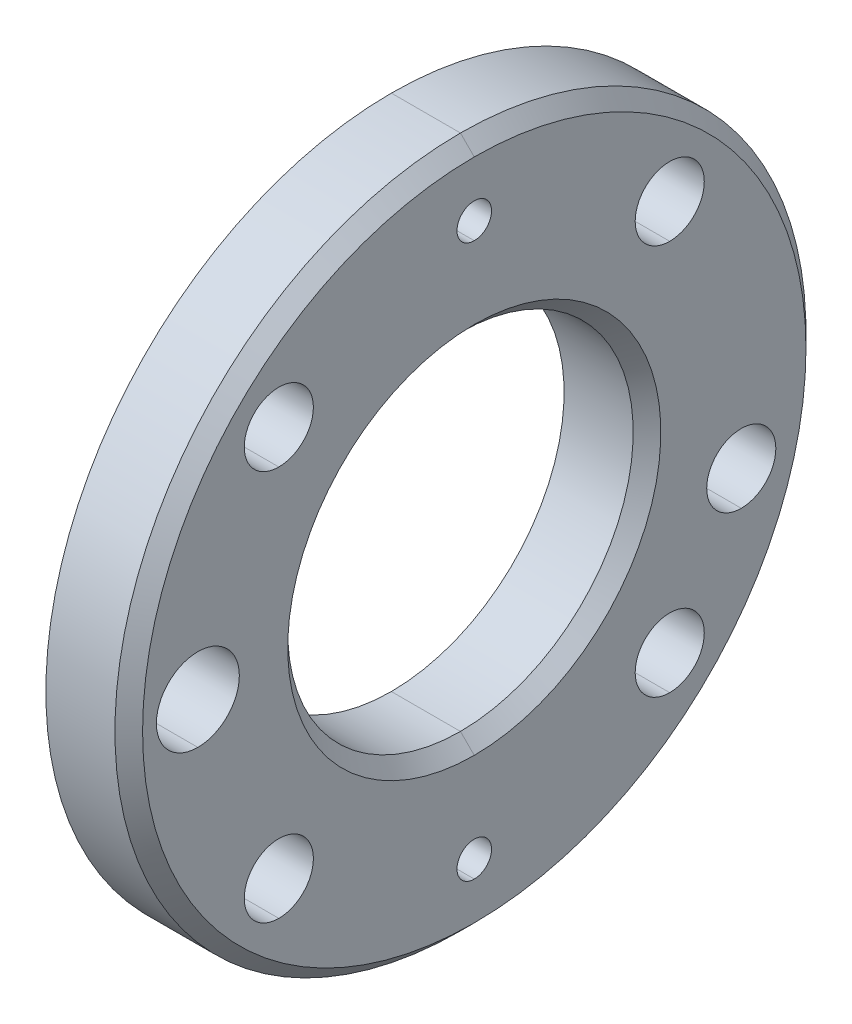
ISO-10303-21;
HEADER;
FILE_DESCRIPTION(('STEP AP214'),'2;1');
FILE_NAME('part.step','',(''),(''),'','','');
FILE_SCHEMA(('AUTOMOTIVE_DESIGN { 1 0 10303 214 1 1 1 1 }'));
ENDSEC;
DATA;
#1=APPLICATION_CONTEXT('core data for automotive mechanical design processes');
#2=APPLICATION_PROTOCOL_DEFINITION('international standard','automotive_design',2000,#1);
#3=PRODUCT_CONTEXT('',#1,'mechanical');
#4=PRODUCT('Part','Part','',(#3));
#5=PRODUCT_RELATED_PRODUCT_CATEGORY('part','',(#4));
#6=PRODUCT_DEFINITION_FORMATION('','',#4);
#7=PRODUCT_DEFINITION_CONTEXT('part definition',#1,'design');
#8=PRODUCT_DEFINITION('design','',#6,#7);
#9=PRODUCT_DEFINITION_SHAPE('','',#8);
#10=(LENGTH_UNIT() NAMED_UNIT(*) SI_UNIT(.MILLI.,.METRE.));
#11=(NAMED_UNIT(*) PLANE_ANGLE_UNIT() SI_UNIT($,.RADIAN.));
#12=(NAMED_UNIT(*) SI_UNIT($,.STERADIAN.) SOLID_ANGLE_UNIT());
#13=UNCERTAINTY_MEASURE_WITH_UNIT(LENGTH_MEASURE(1.E-05),#10,'distance_accuracy_value','');
#14=(GEOMETRIC_REPRESENTATION_CONTEXT(3) GLOBAL_UNCERTAINTY_ASSIGNED_CONTEXT((#13)) GLOBAL_UNIT_ASSIGNED_CONTEXT((#10,
#11,#12)) REPRESENTATION_CONTEXT('',''));
#15=CARTESIAN_POINT('',(0.,0.,0.));
#16=DIRECTION('',(0.,0.,1.));
#17=DIRECTION('',(1.,0.,0.));
#18=AXIS2_PLACEMENT_3D('',#15,#16,#17);
#19=CARTESIAN_POINT('',(559.,1.07884340678323E-10,1009.));
#20=DIRECTION('',(1.,0.,0.));
#21=DIRECTION('',(0.,-1.,0.));
#22=AXIS2_PLACEMENT_3D('',#19,#20,#21);
#23=PLANE('',#22);
#24=CARTESIAN_POINT('',(559.,1.07884340678323E-10,1009.));
#25=DIRECTION('',(-1.,0.,0.));
#26=DIRECTION('',(0.,-0.999972178095451,0.00745942591894533));
#27=AXIS2_PLACEMENT_3D('',#24,#25,#26);
#28=CIRCLE('',#27,12.5);
#29=CARTESIAN_POINT('',(559.,-12.4999999998921,1009.));
#30=VERTEX_POINT('',#29);
#31=CARTESIAN_POINT('',(559.,12.5000000001079,1009.));
#32=VERTEX_POINT('',#31);
#33=EDGE_CURVE('E434',#30,#32,#28,.T.);
#34=ORIENTED_EDGE('',*,*,#33,.F.);
#35=CARTESIAN_POINT('',(559.,1.07884340678323E-10,1009.));
#36=DIRECTION('',(-1.,0.,0.));
#37=DIRECTION('',(0.,-0.999972178095451,0.00745942591894533));
#38=AXIS2_PLACEMENT_3D('',#35,#36,#37);
#39=CIRCLE('',#38,12.5);
#40=EDGE_CURVE('E25',#32,#30,#39,.T.);
#41=ORIENTED_EDGE('',*,*,#40,.F.);
#42=EDGE_LOOP('',(#34,#41));
#43=FACE_BOUND('',#42,.T.);
#44=CARTESIAN_POINT('',(559.,20.0000000001079,1009.));
#45=DIRECTION('',(-1.,0.,0.));
#46=DIRECTION('',(0.,-0.999972178095451,0.0074594259189098));
#47=AXIS2_PLACEMENT_3D('',#44,#45,#46);
#48=CIRCLE('',#47,1.25);
#49=CARTESIAN_POINT('',(559.,21.2500000001079,1009.));
#50=VERTEX_POINT('',#49);
#51=CARTESIAN_POINT('',(559.,18.7500000001079,1009.));
#52=VERTEX_POINT('',#51);
#53=EDGE_CURVE('E356',#50,#52,#48,.T.);
#54=ORIENTED_EDGE('',*,*,#53,.F.);
#55=CARTESIAN_POINT('',(559.,20.0000000001079,1009.));
#56=DIRECTION('',(-1.,0.,0.));
#57=DIRECTION('',(0.,-0.999972178095451,0.0074594259189098));
#58=AXIS2_PLACEMENT_3D('',#55,#56,#57);
#59=CIRCLE('',#58,1.25);
#60=EDGE_CURVE('E459',#52,#50,#59,.T.);
#61=ORIENTED_EDGE('',*,*,#60,.F.);
#62=EDGE_LOOP('',(#54,#61));
#63=FACE_BOUND('',#62,.T.);
#64=CARTESIAN_POINT('',(559.,14.1421356238387,994.857864376269));
#65=DIRECTION('',(-1.,0.,0.));
#66=DIRECTION('',(0.,-0.999972178095451,0.00745942591895421));
#67=AXIS2_PLACEMENT_3D('',#64,#65,#66);
#68=CIRCLE('',#67,2.5);
#69=CARTESIAN_POINT('',(559.,16.6421356238387,994.857864376269));
#70=VERTEX_POINT('',#69);
#71=CARTESIAN_POINT('',(559.,11.6421356238387,994.857864376269));
#72=VERTEX_POINT('',#71);
#73=EDGE_CURVE('E247',#70,#72,#68,.T.);
#74=ORIENTED_EDGE('',*,*,#73,.F.);
#75=CARTESIAN_POINT('',(559.,14.1421356238387,994.857864376269));
#76=DIRECTION('',(-1.,0.,0.));
#77=DIRECTION('',(0.,-0.999972178095451,0.00745942591895421));
#78=AXIS2_PLACEMENT_3D('',#75,#76,#77);
#79=CIRCLE('',#78,2.5);
#80=EDGE_CURVE('E258',#72,#70,#79,.T.);
#81=ORIENTED_EDGE('',*,*,#80,.F.);
#82=EDGE_LOOP('',(#74,#81));
#83=FACE_BOUND('',#82,.T.);
#84=CARTESIAN_POINT('',(559.,-14.1421356236229,1023.14213562373));
#85=DIRECTION('',(-1.,0.,0.));
#86=DIRECTION('',(0.,-0.999972178095451,0.0074594259189098));
#87=AXIS2_PLACEMENT_3D('',#84,#85,#86);
#88=CIRCLE('',#87,2.5);
#89=CARTESIAN_POINT('',(559.,-11.6421356236229,1023.14213562373));
#90=VERTEX_POINT('',#89);
#91=CARTESIAN_POINT('',(559.,-16.6421356236229,1023.14213562373));
#92=VERTEX_POINT('',#91);
#93=EDGE_CURVE('E378',#90,#92,#88,.T.);
#94=ORIENTED_EDGE('',*,*,#93,.F.);
#95=CARTESIAN_POINT('',(559.,-14.1421356236229,1023.14213562373));
#96=DIRECTION('',(-1.,0.,0.));
#97=DIRECTION('',(0.,-0.999972178095451,0.0074594259189098));
#98=AXIS2_PLACEMENT_3D('',#95,#96,#97);
#99=CIRCLE('',#98,2.5);
#100=EDGE_CURVE('E290',#92,#90,#99,.T.);
#101=ORIENTED_EDGE('',*,*,#100,.F.);
#102=EDGE_LOOP('',(#94,#101));
#103=FACE_BOUND('',#102,.T.);
#104=CARTESIAN_POINT('',(559.,1.08042562526819E-10,1029.));
#105=DIRECTION('',(-1.,0.,0.));
#106=DIRECTION('',(0.,-0.999972178095451,0.00745942591895421));
#107=AXIS2_PLACEMENT_3D('',#104,#105,#106);
#108=CIRCLE('',#107,3.);
#109=CARTESIAN_POINT('',(559.,3.00000000010805,1029.));
#110=VERTEX_POINT('',#109);
#111=CARTESIAN_POINT('',(559.,-2.99999999989195,1029.));
#112=VERTEX_POINT('',#111);
#113=EDGE_CURVE('E37',#110,#112,#108,.T.);
#114=ORIENTED_EDGE('',*,*,#113,.F.);
#115=CARTESIAN_POINT('',(559.,1.08042562526819E-10,1029.));
#116=DIRECTION('',(-1.,0.,0.));
#117=DIRECTION('',(0.,-0.999972178095451,0.00745942591895421));
#118=AXIS2_PLACEMENT_3D('',#115,#116,#117);
#119=CIRCLE('',#118,3.);
#120=EDGE_CURVE('E239',#112,#110,#119,.T.);
#121=ORIENTED_EDGE('',*,*,#120,.F.);
#122=EDGE_LOOP('',(#114,#121));
#123=FACE_BOUND('',#122,.T.);
#124=CARTESIAN_POINT('',(559.,-5.1763809019427,989.681483474218));
#125=DIRECTION('',(-1.,0.,0.));
#126=DIRECTION('',(0.,-0.999972178095451,0.00745942591895421));
#127=AXIS2_PLACEMENT_3D('',#124,#125,#126);
#128=CIRCLE('',#127,2.5);
#129=CARTESIAN_POINT('',(559.,-2.6763809019427,989.681483474218));
#130=VERTEX_POINT('',#129);
#131=CARTESIAN_POINT('',(559.,-7.6763809019427,989.681483474218));
#132=VERTEX_POINT('',#131);
#133=EDGE_CURVE('E233',#130,#132,#128,.T.);
#134=ORIENTED_EDGE('',*,*,#133,.F.);
#135=CARTESIAN_POINT('',(559.,-5.1763809019427,989.681483474218));
#136=DIRECTION('',(-1.,0.,0.));
#137=DIRECTION('',(0.,-0.999972178095451,0.00745942591895421));
#138=AXIS2_PLACEMENT_3D('',#135,#136,#137);
#139=CIRCLE('',#138,2.5);
#140=EDGE_CURVE('E307',#132,#130,#139,.T.);
#141=ORIENTED_EDGE('',*,*,#140,.F.);
#142=EDGE_LOOP('',(#134,#141));
#143=FACE_BOUND('',#142,.T.);
#144=CARTESIAN_POINT('',(559.,14.142135623839,1023.14213562373));
#145=DIRECTION('',(-1.,0.,0.));
#146=DIRECTION('',(0.,-0.999972178095451,0.0074594259189098));
#147=AXIS2_PLACEMENT_3D('',#144,#145,#146);
#148=CIRCLE('',#147,2.5);
#149=CARTESIAN_POINT('',(559.,16.642135623839,1023.14213562373));
#150=VERTEX_POINT('',#149);
#151=CARTESIAN_POINT('',(559.,11.642135623839,1023.14213562373));
#152=VERTEX_POINT('',#151);
#153=EDGE_CURVE('E357',#150,#152,#148,.T.);
#154=ORIENTED_EDGE('',*,*,#153,.F.);
#155=CARTESIAN_POINT('',(559.,14.142135623839,1023.14213562373));
#156=DIRECTION('',(-1.,0.,0.));
#157=DIRECTION('',(0.,-0.999972178095451,0.0074594259189098));
#158=AXIS2_PLACEMENT_3D('',#155,#156,#157);
#159=CIRCLE('',#158,2.5);
#160=EDGE_CURVE('E274',#152,#150,#159,.T.);
#161=ORIENTED_EDGE('',*,*,#160,.F.);
#162=EDGE_LOOP('',(#154,#161));
#163=FACE_BOUND('',#162,.T.);
#164=CARTESIAN_POINT('',(559.,-14.1421356236234,994.857864376269));
#165=DIRECTION('',(-1.,0.,0.));
#166=DIRECTION('',(0.,-0.999972178095451,0.00745942591895421));
#167=AXIS2_PLACEMENT_3D('',#164,#165,#166);
#168=CIRCLE('',#167,2.5);
#169=CARTESIAN_POINT('',(559.,-11.6421356236234,994.857864376269));
#170=VERTEX_POINT('',#169);
#171=CARTESIAN_POINT('',(559.,-16.6421356236234,994.857864376269));
#172=VERTEX_POINT('',#171);
#173=EDGE_CURVE('E204',#170,#172,#168,.T.);
#174=ORIENTED_EDGE('',*,*,#173,.F.);
#175=CARTESIAN_POINT('',(559.,-14.1421356236234,994.857864376269));
#176=DIRECTION('',(-1.,0.,0.));
#177=DIRECTION('',(0.,-0.999972178095451,0.00745942591895421));
#178=AXIS2_PLACEMENT_3D('',#175,#176,#177);
#179=CIRCLE('',#178,2.5);
#180=EDGE_CURVE('E216',#172,#170,#179,.T.);
#181=ORIENTED_EDGE('',*,*,#180,.F.);
#182=EDGE_LOOP('',(#174,#181));
#183=FACE_BOUND('',#182,.T.);
#184=CARTESIAN_POINT('',(559.,-19.9999999998921,1009.));
#185=DIRECTION('',(-1.,0.,0.));
#186=DIRECTION('',(0.,-0.999972178095451,0.0074594259189098));
#187=AXIS2_PLACEMENT_3D('',#184,#185,#186);
#188=CIRCLE('',#187,1.25);
#189=CARTESIAN_POINT('',(559.,-18.7499999998921,1009.));
#190=VERTEX_POINT('',#189);
#191=CARTESIAN_POINT('',(559.,-21.2499999998921,1009.));
#192=VERTEX_POINT('',#191);
#193=EDGE_CURVE('E244',#190,#192,#188,.T.);
#194=ORIENTED_EDGE('',*,*,#193,.F.);
#195=CARTESIAN_POINT('',(559.,-19.9999999998921,1009.));
#196=DIRECTION('',(-1.,0.,0.));
#197=DIRECTION('',(0.,-0.999972178095451,0.0074594259189098));
#198=AXIS2_PLACEMENT_3D('',#195,#196,#197);
#199=CIRCLE('',#198,1.25);
#200=EDGE_CURVE('E405',#192,#190,#199,.T.);
#201=ORIENTED_EDGE('',*,*,#200,.F.);
#202=EDGE_LOOP('',(#194,#201));
#203=FACE_BOUND('',#202,.T.);
#204=CARTESIAN_POINT('',(559.,1.07884340678323E-10,1009.));
#205=DIRECTION('',(-1.,0.,0.));
#206=DIRECTION('',(0.,-0.999972178095451,0.00745942591894533));
#207=AXIS2_PLACEMENT_3D('',#204,#205,#206);
#208=CIRCLE('',#207,25.);
#209=CARTESIAN_POINT('',(559.,-24.9999999998921,1009.));
#210=VERTEX_POINT('',#209);
#211=CARTESIAN_POINT('',(559.,25.0000000001079,1009.));
#212=VERTEX_POINT('',#211);
#213=EDGE_CURVE('E11',#210,#212,#208,.T.);
#214=ORIENTED_EDGE('',*,*,#213,.T.);
#215=CARTESIAN_POINT('',(559.,1.07884340678323E-10,1009.));
#216=DIRECTION('',(-1.,0.,0.));
#217=DIRECTION('',(0.,-0.999972178095451,0.00745942591894533));
#218=AXIS2_PLACEMENT_3D('',#215,#216,#217);
#219=CIRCLE('',#218,25.);
#220=EDGE_CURVE('E543',#212,#210,#219,.T.);
#221=ORIENTED_EDGE('',*,*,#220,.T.);
#222=EDGE_LOOP('',(#214,#221));
#223=FACE_BOUND('',#222,.T.);
#224=ADVANCED_FACE('F17',(#43,#63,#83,#103,#123,#143,#163,#183,#203,#223),#23,.F.);
#225=CARTESIAN_POINT('',(565.,1.0803998754666E-10,1034.));
#226=DIRECTION('',(1.,0.,0.));
#227=DIRECTION('',(0.,-1.,0.));
#228=AXIS2_PLACEMENT_3D('',#225,#226,#227);
#229=PLANE('',#228);
#230=CARTESIAN_POINT('',(565.,-19.9999999998922,1009.));
#231=DIRECTION('',(-1.,0.,0.));
#232=DIRECTION('',(0.,1.,0.));
#233=AXIS2_PLACEMENT_3D('',#230,#231,#232);
#234=CIRCLE('',#233,1.25);
#235=CARTESIAN_POINT('',(565.,-18.7499999998922,1009.));
#236=VERTEX_POINT('',#235);
#237=CARTESIAN_POINT('',(565.,-21.2499999998922,1009.));
#238=VERTEX_POINT('',#237);
#239=EDGE_CURVE('E352',#236,#238,#234,.T.);
#240=ORIENTED_EDGE('',*,*,#239,.T.);
#241=CARTESIAN_POINT('',(565.,-19.9999999998922,1009.));
#242=DIRECTION('',(-1.,0.,0.));
#243=DIRECTION('',(0.,1.,0.));
#244=AXIS2_PLACEMENT_3D('',#241,#242,#243);
#245=CIRCLE('',#244,1.25);
#246=EDGE_CURVE('E412',#238,#236,#245,.T.);
#247=ORIENTED_EDGE('',*,*,#246,.T.);
#248=EDGE_LOOP('',(#240,#247));
#249=FACE_BOUND('',#248,.T.);
#250=CARTESIAN_POINT('',(565.,20.0000000001079,1009.));
#251=DIRECTION('',(-1.,0.,0.));
#252=DIRECTION('',(0.,1.,0.));
#253=AXIS2_PLACEMENT_3D('',#250,#251,#252);
#254=CIRCLE('',#253,1.25);
#255=CARTESIAN_POINT('',(565.,21.2500000001079,1009.));
#256=VERTEX_POINT('',#255);
#257=CARTESIAN_POINT('',(565.,18.7500000001078,1009.));
#258=VERTEX_POINT('',#257);
#259=EDGE_CURVE('E214',#256,#258,#254,.T.);
#260=ORIENTED_EDGE('',*,*,#259,.T.);
#261=CARTESIAN_POINT('',(565.,20.0000000001079,1009.));
#262=DIRECTION('',(-1.,0.,0.));
#263=DIRECTION('',(0.,1.,0.));
#264=AXIS2_PLACEMENT_3D('',#261,#262,#263);
#265=CIRCLE('',#264,1.25);
#266=EDGE_CURVE('E451',#258,#256,#265,.T.);
#267=ORIENTED_EDGE('',*,*,#266,.T.);
#268=EDGE_LOOP('',(#260,#267));
#269=FACE_BOUND('',#268,.T.);
#270=CARTESIAN_POINT('',(565.,-14.1421356236234,994.857864376269));
#271=DIRECTION('',(-1.,0.,0.));
#272=DIRECTION('',(0.,1.,0.));
#273=AXIS2_PLACEMENT_3D('',#270,#271,#272);
#274=CIRCLE('',#273,2.5);
#275=CARTESIAN_POINT('',(565.,-11.6421356236234,994.857864376269));
#276=VERTEX_POINT('',#275);
#277=CARTESIAN_POINT('',(565.,-16.6421356236234,994.857864376269));
#278=VERTEX_POINT('',#277);
#279=EDGE_CURVE('E199',#276,#278,#274,.T.);
#280=ORIENTED_EDGE('',*,*,#279,.T.);
#281=CARTESIAN_POINT('',(565.,-14.1421356236234,994.857864376269));
#282=DIRECTION('',(-1.,0.,0.));
#283=DIRECTION('',(0.,1.,0.));
#284=AXIS2_PLACEMENT_3D('',#281,#282,#283);
#285=CIRCLE('',#284,2.5);
#286=EDGE_CURVE('E223',#278,#276,#285,.T.);
#287=ORIENTED_EDGE('',*,*,#286,.T.);
#288=EDGE_LOOP('',(#280,#287));
#289=FACE_BOUND('',#288,.T.);
#290=CARTESIAN_POINT('',(565.,14.1421356238387,994.857864376269));
#291=DIRECTION('',(-1.,0.,0.));
#292=DIRECTION('',(0.,1.,0.));
#293=AXIS2_PLACEMENT_3D('',#290,#291,#292);
#294=CIRCLE('',#293,2.5);
#295=CARTESIAN_POINT('',(565.,16.6421356238387,994.857864376269));
#296=VERTEX_POINT('',#295);
#297=CARTESIAN_POINT('',(565.,11.6421356238387,994.857864376269));
#298=VERTEX_POINT('',#297);
#299=EDGE_CURVE('E360',#296,#298,#294,.T.);
#300=ORIENTED_EDGE('',*,*,#299,.T.);
#301=CARTESIAN_POINT('',(565.,14.1421356238387,994.857864376269));
#302=DIRECTION('',(-1.,0.,0.));
#303=DIRECTION('',(0.,1.,0.));
#304=AXIS2_PLACEMENT_3D('',#301,#302,#303);
#305=CIRCLE('',#304,2.5);
#306=EDGE_CURVE('E250',#298,#296,#305,.T.);
#307=ORIENTED_EDGE('',*,*,#306,.T.);
#308=EDGE_LOOP('',(#300,#307));
#309=FACE_BOUND('',#308,.T.);
#310=CARTESIAN_POINT('',(565.,14.142135623839,1023.14213562373));
#311=DIRECTION('',(-1.,0.,0.));
#312=DIRECTION('',(0.,1.,0.));
#313=AXIS2_PLACEMENT_3D('',#310,#311,#312);
#314=CIRCLE('',#313,2.5);
#315=CARTESIAN_POINT('',(565.,16.642135623839,1023.14213562373));
#316=VERTEX_POINT('',#315);
#317=CARTESIAN_POINT('',(565.,11.642135623839,1023.14213562373));
#318=VERTEX_POINT('',#317);
#319=EDGE_CURVE('E361',#316,#318,#314,.T.);
#320=ORIENTED_EDGE('',*,*,#319,.T.);
#321=CARTESIAN_POINT('',(565.,14.142135623839,1023.14213562373));
#322=DIRECTION('',(-1.,0.,0.));
#323=DIRECTION('',(0.,1.,0.));
#324=AXIS2_PLACEMENT_3D('',#321,#322,#323);
#325=CIRCLE('',#324,2.5);
#326=EDGE_CURVE('E266',#318,#316,#325,.T.);
#327=ORIENTED_EDGE('',*,*,#326,.T.);
#328=EDGE_LOOP('',(#320,#327));
#329=FACE_BOUND('',#328,.T.);
#330=CARTESIAN_POINT('',(565.,-14.142135623623,1023.14213562373));
#331=DIRECTION('',(-1.,0.,0.));
#332=DIRECTION('',(0.,1.,0.));
#333=AXIS2_PLACEMENT_3D('',#330,#331,#332);
#334=CIRCLE('',#333,2.5);
#335=CARTESIAN_POINT('',(565.,-11.642135623623,1023.14213562373));
#336=VERTEX_POINT('',#335);
#337=CARTESIAN_POINT('',(565.,-16.642135623623,1023.14213562373));
#338=VERTEX_POINT('',#337);
#339=EDGE_CURVE('E375',#336,#338,#334,.T.);
#340=ORIENTED_EDGE('',*,*,#339,.T.);
#341=CARTESIAN_POINT('',(565.,-14.142135623623,1023.14213562373));
#342=DIRECTION('',(-1.,0.,0.));
#343=DIRECTION('',(0.,1.,0.));
#344=AXIS2_PLACEMENT_3D('',#341,#342,#343);
#345=CIRCLE('',#344,2.5);
#346=EDGE_CURVE('E282',#338,#336,#345,.T.);
#347=ORIENTED_EDGE('',*,*,#346,.T.);
#348=EDGE_LOOP('',(#340,#347));
#349=FACE_BOUND('',#348,.T.);
#350=CARTESIAN_POINT('',(565.,1.07842450208488E-10,1009.));
#351=DIRECTION('',(-1.,0.,0.));
#352=DIRECTION('',(0.,1.,0.));
#353=AXIS2_PLACEMENT_3D('',#350,#351,#352);
#354=CIRCLE('',#353,13.5);
#355=CARTESIAN_POINT('',(565.,13.5000000001078,1009.));
#356=VERTEX_POINT('',#355);
#357=CARTESIAN_POINT('',(565.,-13.4999999998922,1009.));
#358=VERTEX_POINT('',#357);
#359=EDGE_CURVE('E312',#356,#358,#354,.T.);
#360=ORIENTED_EDGE('',*,*,#359,.T.);
#361=CARTESIAN_POINT('',(565.,1.07842450208488E-10,1009.));
#362=DIRECTION('',(-1.,0.,0.));
#363=DIRECTION('',(0.,1.,0.));
#364=AXIS2_PLACEMENT_3D('',#361,#362,#363);
#365=CIRCLE('',#364,13.5);
#366=EDGE_CURVE('E371',#358,#356,#365,.T.);
#367=ORIENTED_EDGE('',*,*,#366,.T.);
#368=EDGE_LOOP('',(#360,#367));
#369=FACE_BOUND('',#368,.T.);
#370=CARTESIAN_POINT('',(565.,-5.17638090194274,989.681483474218));
#371=DIRECTION('',(-1.,0.,0.));
#372=DIRECTION('',(0.,1.,0.));
#373=AXIS2_PLACEMENT_3D('',#370,#371,#372);
#374=CIRCLE('',#373,2.5);
#375=CARTESIAN_POINT('',(565.,-2.67638090194274,989.681483474218));
#376=VERTEX_POINT('',#375);
#377=CARTESIAN_POINT('',(565.,-7.67638090194274,989.681483474218));
#378=VERTEX_POINT('',#377);
#379=EDGE_CURVE('E368',#376,#378,#374,.T.);
#380=ORIENTED_EDGE('',*,*,#379,.T.);
#381=CARTESIAN_POINT('',(565.,-5.17638090194274,989.681483474218));
#382=DIRECTION('',(-1.,0.,0.));
#383=DIRECTION('',(0.,1.,0.));
#384=AXIS2_PLACEMENT_3D('',#381,#382,#383);
#385=CIRCLE('',#384,2.5);
#386=EDGE_CURVE('E308',#378,#376,#385,.T.);
#387=ORIENTED_EDGE('',*,*,#386,.T.);
#388=EDGE_LOOP('',(#380,#387));
#389=FACE_BOUND('',#388,.T.);
#390=CARTESIAN_POINT('',(565.,1.08000631007799E-10,1029.));
#391=DIRECTION('',(-1.,0.,0.));
#392=DIRECTION('',(0.,1.,0.));
#393=AXIS2_PLACEMENT_3D('',#390,#391,#392);
#394=CIRCLE('',#393,3.);
#395=CARTESIAN_POINT('',(565.,3.000000000108,1029.));
#396=VERTEX_POINT('',#395);
#397=CARTESIAN_POINT('',(565.,-2.999999999892,1029.));
#398=VERTEX_POINT('',#397);
#399=EDGE_CURVE('E351',#396,#398,#394,.T.);
#400=ORIENTED_EDGE('',*,*,#399,.T.);
#401=CARTESIAN_POINT('',(565.,1.08000631007799E-10,1029.));
#402=DIRECTION('',(-1.,0.,0.));
#403=DIRECTION('',(0.,1.,0.));
#404=AXIS2_PLACEMENT_3D('',#401,#402,#403);
#405=CIRCLE('',#404,3.);
#406=EDGE_CURVE('E240',#398,#396,#405,.T.);
#407=ORIENTED_EDGE('',*,*,#406,.T.);
#408=EDGE_LOOP('',(#400,#407));
#409=FACE_BOUND('',#408,.T.);
#410=CARTESIAN_POINT('',(565.,1.07842519597427E-10,1009.));
#411=DIRECTION('',(-1.,0.,0.));
#412=DIRECTION('',(0.,-1.,0.));
#413=AXIS2_PLACEMENT_3D('',#410,#411,#412);
#414=CIRCLE('',#413,24.);
#415=CARTESIAN_POINT('',(565.,-23.9999999998922,1009.));
#416=VERTEX_POINT('',#415);
#417=CARTESIAN_POINT('',(565.,24.0000000001079,1009.));
#418=VERTEX_POINT('',#417);
#419=EDGE_CURVE('E330',#416,#418,#414,.T.);
#420=ORIENTED_EDGE('',*,*,#419,.F.);
#421=CARTESIAN_POINT('',(565.,1.07842519597427E-10,1009.));
#422=DIRECTION('',(-1.,0.,0.));
#423=DIRECTION('',(0.,-1.,0.));
#424=AXIS2_PLACEMENT_3D('',#421,#422,#423);
#425=CIRCLE('',#424,24.);
#426=EDGE_CURVE('E129',#418,#416,#425,.T.);
#427=ORIENTED_EDGE('',*,*,#426,.F.);
#428=EDGE_LOOP('',(#420,#427));
#429=FACE_BOUND('',#428,.T.);
#430=ADVANCED_FACE('F497',(#249,#269,#289,#309,#329,#349,#369,#389,#409,#429),#229,.T.);
#431=CARTESIAN_POINT('',(544.1,1.07988368678414E-10,1009.));
#432=DIRECTION('',(1.,0.,0.));
#433=DIRECTION('',(0.,-1.,0.));
#434=AXIS2_PLACEMENT_3D('',#431,#432,#433);
#435=CYLINDRICAL_SURFACE('',#434,25.);
#436=DIRECTION('',(1.,0.,0.));
#437=VECTOR('',#436,1.);
#438=CARTESIAN_POINT('',(544.1,25.000000000108,1009.));
#439=LINE('',#438,#437);
#440=CARTESIAN_POINT('',(564.,25.0000000001079,1009.));
#441=VERTEX_POINT('',#440);
#442=EDGE_CURVE('E422',#212,#441,#439,.T.);
#443=ORIENTED_EDGE('',*,*,#442,.F.);
#444=ORIENTED_EDGE('',*,*,#213,.F.);
#445=DIRECTION('',(1.,0.,0.));
#446=VECTOR('',#445,1.);
#447=CARTESIAN_POINT('',(544.1,-24.999999999892,1009.));
#448=LINE('',#447,#446);
#449=CARTESIAN_POINT('',(564.,-24.9999999998921,1009.));
#450=VERTEX_POINT('',#449);
#451=EDGE_CURVE('E435',#210,#450,#448,.T.);
#452=ORIENTED_EDGE('',*,*,#451,.T.);
#453=CARTESIAN_POINT('',(564.,1.07849431953461E-10,1009.));
#454=DIRECTION('',(-1.,0.,0.));
#455=DIRECTION('',(0.,-1.,0.));
#456=AXIS2_PLACEMENT_3D('',#453,#454,#455);
#457=CIRCLE('',#456,25.);
#458=EDGE_CURVE('E335',#450,#441,#457,.T.);
#459=ORIENTED_EDGE('',*,*,#458,.T.);
#460=EDGE_LOOP('',(#443,#444,#452,#459));
#461=FACE_BOUND('',#460,.T.);
#462=ADVANCED_FACE('F523',(#461),#435,.T.);
#463=CARTESIAN_POINT('',(544.1,1.07988368678414E-10,1009.));
#464=DIRECTION('',(1.,0.,0.));
#465=DIRECTION('',(0.,-1.,0.));
#466=AXIS2_PLACEMENT_3D('',#463,#464,#465);
#467=CYLINDRICAL_SURFACE('',#466,12.5);
#468=DIRECTION('',(1.,0.,0.));
#469=VECTOR('',#468,1.);
#470=CARTESIAN_POINT('',(544.1,12.500000000108,1009.));
#471=LINE('',#470,#469);
#472=CARTESIAN_POINT('',(564.,12.5000000001078,1009.));
#473=VERTEX_POINT('',#472);
#474=EDGE_CURVE('E429',#32,#473,#471,.T.);
#475=ORIENTED_EDGE('',*,*,#474,.F.);
#476=ORIENTED_EDGE('',*,*,#40,.T.);
#477=DIRECTION('',(1.,0.,0.));
#478=VECTOR('',#477,1.);
#479=CARTESIAN_POINT('',(544.1,-12.499999999892,1009.));
#480=LINE('',#479,#478);
#481=CARTESIAN_POINT('',(564.,-12.4999999998921,1009.));
#482=VERTEX_POINT('',#481);
#483=EDGE_CURVE('E418',#30,#482,#480,.T.);
#484=ORIENTED_EDGE('',*,*,#483,.T.);
#485=CARTESIAN_POINT('',(564.,1.07849431953461E-10,1009.));
#486=DIRECTION('',(1.,0.,0.));
#487=DIRECTION('',(0.,1.,0.));
#488=AXIS2_PLACEMENT_3D('',#485,#486,#487);
#489=CIRCLE('',#488,12.5);
#490=EDGE_CURVE('E298',#482,#473,#489,.T.);
#491=ORIENTED_EDGE('',*,*,#490,.T.);
#492=EDGE_LOOP('',(#475,#476,#484,#491));
#493=FACE_BOUND('',#492,.T.);
#494=ADVANCED_FACE('F563',(#493),#467,.F.);
#495=CARTESIAN_POINT('',(565.,-19.9999999998922,1009.));
#496=DIRECTION('',(-1.,0.,0.));
#497=DIRECTION('',(0.,1.,0.));
#498=AXIS2_PLACEMENT_3D('',#495,#496,#497);
#499=CYLINDRICAL_SURFACE('',#498,1.25);
#500=DIRECTION('',(-1.,0.,0.));
#501=VECTOR('',#500,1.);
#502=CARTESIAN_POINT('',(565.,-21.2499999998922,1009.));
#503=LINE('',#502,#501);
#504=EDGE_CURVE('E400',#238,#192,#503,.T.);
#505=ORIENTED_EDGE('',*,*,#504,.F.);
#506=ORIENTED_EDGE('',*,*,#239,.F.);
#507=DIRECTION('',(-1.,0.,0.));
#508=VECTOR('',#507,1.);
#509=CARTESIAN_POINT('',(565.,-18.7499999998922,1009.));
#510=LINE('',#509,#508);
#511=EDGE_CURVE('E403',#236,#190,#510,.T.);
#512=ORIENTED_EDGE('',*,*,#511,.T.);
#513=ORIENTED_EDGE('',*,*,#193,.T.);
#514=EDGE_LOOP('',(#505,#506,#512,#513));
#515=FACE_BOUND('',#514,.T.);
#516=ADVANCED_FACE('F398',(#515),#499,.F.);
#517=CARTESIAN_POINT('',(565.,20.0000000001079,1009.));
#518=DIRECTION('',(-1.,0.,0.));
#519=DIRECTION('',(0.,1.,0.));
#520=AXIS2_PLACEMENT_3D('',#517,#518,#519);
#521=CYLINDRICAL_SURFACE('',#520,1.25);
#522=DIRECTION('',(-1.,0.,0.));
#523=VECTOR('',#522,1.);
#524=CARTESIAN_POINT('',(565.,18.7500000001078,1009.));
#525=LINE('',#524,#523);
#526=EDGE_CURVE('E455',#258,#52,#525,.T.);
#527=ORIENTED_EDGE('',*,*,#526,.F.);
#528=ORIENTED_EDGE('',*,*,#259,.F.);
#529=DIRECTION('',(-1.,0.,0.));
#530=VECTOR('',#529,1.);
#531=CARTESIAN_POINT('',(565.,21.2500000001079,1009.));
#532=LINE('',#531,#530);
#533=EDGE_CURVE('E230',#256,#50,#532,.T.);
#534=ORIENTED_EDGE('',*,*,#533,.T.);
#535=ORIENTED_EDGE('',*,*,#53,.T.);
#536=EDGE_LOOP('',(#527,#528,#534,#535));
#537=FACE_BOUND('',#536,.T.);
#538=ADVANCED_FACE('F469',(#537),#521,.F.);
#539=CARTESIAN_POINT('',(565.,-14.1421356236234,994.857864376269));
#540=DIRECTION('',(-1.,0.,0.));
#541=DIRECTION('',(0.,1.,0.));
#542=AXIS2_PLACEMENT_3D('',#539,#540,#541);
#543=CYLINDRICAL_SURFACE('',#542,2.5);
#544=DIRECTION('',(-1.,0.,0.));
#545=VECTOR('',#544,1.);
#546=CARTESIAN_POINT('',(565.,-16.6421356236234,994.857864376269));
#547=LINE('',#546,#545);
#548=EDGE_CURVE('E208',#278,#172,#547,.T.);
#549=ORIENTED_EDGE('',*,*,#548,.F.);
#550=ORIENTED_EDGE('',*,*,#279,.F.);
#551=DIRECTION('',(-1.,0.,0.));
#552=VECTOR('',#551,1.);
#553=CARTESIAN_POINT('',(565.,-11.6421356236234,994.857864376269));
#554=LINE('',#553,#552);
#555=EDGE_CURVE('E210',#276,#170,#554,.T.);
#556=ORIENTED_EDGE('',*,*,#555,.T.);
#557=ORIENTED_EDGE('',*,*,#173,.T.);
#558=EDGE_LOOP('',(#549,#550,#556,#557));
#559=FACE_BOUND('',#558,.T.);
#560=ADVANCED_FACE('F206',(#559),#543,.F.);
#561=CARTESIAN_POINT('',(565.,14.1421356238387,994.857864376269));
#562=DIRECTION('',(-1.,0.,0.));
#563=DIRECTION('',(0.,1.,0.));
#564=AXIS2_PLACEMENT_3D('',#561,#562,#563);
#565=CYLINDRICAL_SURFACE('',#564,2.5);
#566=DIRECTION('',(-1.,0.,0.));
#567=VECTOR('',#566,1.);
#568=CARTESIAN_POINT('',(565.,11.6421356238387,994.857864376269));
#569=LINE('',#568,#567);
#570=EDGE_CURVE('E254',#298,#72,#569,.T.);
#571=ORIENTED_EDGE('',*,*,#570,.F.);
#572=ORIENTED_EDGE('',*,*,#299,.F.);
#573=DIRECTION('',(-1.,0.,0.));
#574=VECTOR('',#573,1.);
#575=CARTESIAN_POINT('',(565.,16.6421356238387,994.857864376269));
#576=LINE('',#575,#574);
#577=EDGE_CURVE('E262',#296,#70,#576,.T.);
#578=ORIENTED_EDGE('',*,*,#577,.T.);
#579=ORIENTED_EDGE('',*,*,#73,.T.);
#580=EDGE_LOOP('',(#571,#572,#578,#579));
#581=FACE_BOUND('',#580,.T.);
#582=ADVANCED_FACE('F502',(#581),#565,.F.);
#583=CARTESIAN_POINT('',(565.,14.142135623839,1023.14213562373));
#584=DIRECTION('',(-1.,0.,0.));
#585=DIRECTION('',(0.,1.,0.));
#586=AXIS2_PLACEMENT_3D('',#583,#584,#585);
#587=CYLINDRICAL_SURFACE('',#586,2.5);
#588=DIRECTION('',(-1.,0.,0.));
#589=VECTOR('',#588,1.);
#590=CARTESIAN_POINT('',(565.,11.642135623839,1023.14213562373));
#591=LINE('',#590,#589);
#592=EDGE_CURVE('E270',#318,#152,#591,.T.);
#593=ORIENTED_EDGE('',*,*,#592,.F.);
#594=ORIENTED_EDGE('',*,*,#319,.F.);
#595=DIRECTION('',(-1.,0.,0.));
#596=VECTOR('',#595,1.);
#597=CARTESIAN_POINT('',(565.,16.642135623839,1023.14213562373));
#598=LINE('',#597,#596);
#599=EDGE_CURVE('E278',#316,#150,#598,.T.);
#600=ORIENTED_EDGE('',*,*,#599,.T.);
#601=ORIENTED_EDGE('',*,*,#153,.T.);
#602=EDGE_LOOP('',(#593,#594,#600,#601));
#603=FACE_BOUND('',#602,.T.);
#604=ADVANCED_FACE('F517',(#603),#587,.F.);
#605=CARTESIAN_POINT('',(565.,-14.142135623623,1023.14213562373));
#606=DIRECTION('',(-1.,0.,0.));
#607=DIRECTION('',(0.,1.,0.));
#608=AXIS2_PLACEMENT_3D('',#605,#606,#607);
#609=CYLINDRICAL_SURFACE('',#608,2.5);
#610=DIRECTION('',(-1.,0.,0.));
#611=VECTOR('',#610,1.);
#612=CARTESIAN_POINT('',(565.,-16.642135623623,1023.14213562373));
#613=LINE('',#612,#611);
#614=EDGE_CURVE('E286',#338,#92,#613,.T.);
#615=ORIENTED_EDGE('',*,*,#614,.F.);
#616=ORIENTED_EDGE('',*,*,#339,.F.);
#617=DIRECTION('',(-1.,0.,0.));
#618=VECTOR('',#617,1.);
#619=CARTESIAN_POINT('',(565.,-11.642135623623,1023.14213562373));
#620=LINE('',#619,#618);
#621=EDGE_CURVE('E294',#336,#90,#620,.T.);
#622=ORIENTED_EDGE('',*,*,#621,.T.);
#623=ORIENTED_EDGE('',*,*,#93,.T.);
#624=EDGE_LOOP('',(#615,#616,#622,#623));
#625=FACE_BOUND('',#624,.T.);
#626=ADVANCED_FACE('F597',(#625),#609,.F.);
#627=CARTESIAN_POINT('',(565.,1.07842450208488E-10,1009.));
#628=DIRECTION('',(1.,0.,0.));
#629=DIRECTION('',(0.,1.,0.));
#630=AXIS2_PLACEMENT_3D('',#627,#628,#629);
#631=CONICAL_SURFACE('',#630,13.5,0.785398163397446);
#632=DIRECTION('',(0.707106781186544,-0.707106781186551,0.));
#633=VECTOR('',#632,1.);
#634=CARTESIAN_POINT('',(565.,-13.4999999998922,1009.));
#635=LINE('',#634,#633);
#636=EDGE_CURVE('E302',#482,#358,#635,.T.);
#637=ORIENTED_EDGE('',*,*,#636,.F.);
#638=CARTESIAN_POINT('',(564.,1.07849431953461E-10,1009.));
#639=DIRECTION('',(1.,0.,0.));
#640=DIRECTION('',(0.,1.,0.));
#641=AXIS2_PLACEMENT_3D('',#638,#639,#640);
#642=CIRCLE('',#641,12.5);
#643=EDGE_CURVE('E433',#473,#482,#642,.T.);
#644=ORIENTED_EDGE('',*,*,#643,.F.);
#645=DIRECTION('',(0.707106781186554,0.707106781186541,0.));
#646=VECTOR('',#645,1.);
#647=CARTESIAN_POINT('',(565.,13.5000000001078,1009.));
#648=LINE('',#647,#646);
#649=EDGE_CURVE('E313',#473,#356,#648,.T.);
#650=ORIENTED_EDGE('',*,*,#649,.T.);
#651=ORIENTED_EDGE('',*,*,#366,.F.);
#652=EDGE_LOOP('',(#637,#644,#650,#651));
#653=FACE_BOUND('',#652,.T.);
#654=ADVANCED_FACE('F568',(#653),#631,.F.);
#655=CARTESIAN_POINT('',(565.,-5.17638090194274,989.681483474218));
#656=DIRECTION('',(-1.,0.,0.));
#657=DIRECTION('',(0.,1.,0.));
#658=AXIS2_PLACEMENT_3D('',#655,#656,#657);
#659=CYLINDRICAL_SURFACE('',#658,2.5);
#660=DIRECTION('',(-1.,0.,0.));
#661=VECTOR('',#660,1.);
#662=CARTESIAN_POINT('',(565.,-7.67638090194274,989.681483474218));
#663=LINE('',#662,#661);
#664=EDGE_CURVE('E303',#378,#132,#663,.T.);
#665=ORIENTED_EDGE('',*,*,#664,.F.);
#666=ORIENTED_EDGE('',*,*,#379,.F.);
#667=DIRECTION('',(-1.,0.,0.));
#668=VECTOR('',#667,1.);
#669=CARTESIAN_POINT('',(565.,-2.67638090194274,989.681483474218));
#670=LINE('',#669,#668);
#671=EDGE_CURVE('E326',#376,#130,#670,.T.);
#672=ORIENTED_EDGE('',*,*,#671,.T.);
#673=ORIENTED_EDGE('',*,*,#133,.T.);
#674=EDGE_LOOP('',(#665,#666,#672,#673));
#675=FACE_BOUND('',#674,.T.);
#676=ADVANCED_FACE('F596',(#675),#659,.F.);
#677=CARTESIAN_POINT('',(564.,1.07849431953461E-10,1009.));
#678=DIRECTION('',(-1.,0.,0.));
#679=DIRECTION('',(0.,-1.,0.));
#680=AXIS2_PLACEMENT_3D('',#677,#678,#679);
#681=CONICAL_SURFACE('',#680,25.,0.785398163397452);
#682=DIRECTION('',(-0.70710678118654,0.707106781186555,0.));
#683=VECTOR('',#682,1.);
#684=CARTESIAN_POINT('',(564.,25.0000000001079,1009.));
#685=LINE('',#684,#683);
#686=EDGE_CURVE('E331',#418,#441,#685,.T.);
#687=ORIENTED_EDGE('',*,*,#686,.F.);
#688=ORIENTED_EDGE('',*,*,#426,.T.);
#689=DIRECTION('',(-0.70710678118655,-0.707106781186545,0.));
#690=VECTOR('',#689,1.);
#691=CARTESIAN_POINT('',(564.,-24.9999999998922,1009.));
#692=LINE('',#691,#690);
#693=EDGE_CURVE('E339',#416,#450,#692,.T.);
#694=ORIENTED_EDGE('',*,*,#693,.T.);
#695=CARTESIAN_POINT('',(564.,1.07849431953461E-10,1009.));
#696=DIRECTION('',(-1.,0.,0.));
#697=DIRECTION('',(0.,-1.,0.));
#698=AXIS2_PLACEMENT_3D('',#695,#696,#697);
#699=CIRCLE('',#698,25.);
#700=EDGE_CURVE('E439',#441,#450,#699,.T.);
#701=ORIENTED_EDGE('',*,*,#700,.F.);
#702=EDGE_LOOP('',(#687,#688,#694,#701));
#703=FACE_BOUND('',#702,.T.);
#704=ADVANCED_FACE('F535',(#703),#681,.T.);
#705=CARTESIAN_POINT('',(565.,1.08000631007799E-10,1029.));
#706=DIRECTION('',(-1.,0.,0.));
#707=DIRECTION('',(0.,1.,0.));
#708=AXIS2_PLACEMENT_3D('',#705,#706,#707);
#709=CYLINDRICAL_SURFACE('',#708,3.);
#710=DIRECTION('',(-1.,0.,0.));
#711=VECTOR('',#710,1.);
#712=CARTESIAN_POINT('',(565.,-2.999999999892,1029.));
#713=LINE('',#712,#711);
#714=EDGE_CURVE('E236',#398,#112,#713,.T.);
#715=ORIENTED_EDGE('',*,*,#714,.F.);
#716=ORIENTED_EDGE('',*,*,#399,.F.);
#717=DIRECTION('',(-1.,0.,0.));
#718=VECTOR('',#717,1.);
#719=CARTESIAN_POINT('',(565.,3.000000000108,1029.));
#720=LINE('',#719,#718);
#721=EDGE_CURVE('E348',#396,#110,#720,.T.);
#722=ORIENTED_EDGE('',*,*,#721,.T.);
#723=ORIENTED_EDGE('',*,*,#113,.T.);
#724=EDGE_LOOP('',(#715,#716,#722,#723));
#725=FACE_BOUND('',#724,.T.);
#726=ADVANCED_FACE('F585',(#725),#709,.F.);
#727=CARTESIAN_POINT('',(565.,1.08000631007799E-10,1029.));
#728=DIRECTION('',(-1.,0.,0.));
#729=DIRECTION('',(0.,1.,0.));
#730=AXIS2_PLACEMENT_3D('',#727,#728,#729);
#731=CYLINDRICAL_SURFACE('',#730,3.);
#732=ORIENTED_EDGE('',*,*,#406,.F.);
#733=ORIENTED_EDGE('',*,*,#714,.T.);
#734=ORIENTED_EDGE('',*,*,#120,.T.);
#735=ORIENTED_EDGE('',*,*,#721,.F.);
#736=EDGE_LOOP('',(#732,#733,#734,#735));
#737=FACE_BOUND('',#736,.T.);
#738=ADVANCED_FACE('F588',(#737),#731,.F.);
#739=CARTESIAN_POINT('',(564.,1.07849431953461E-10,1009.));
#740=DIRECTION('',(-1.,0.,0.));
#741=DIRECTION('',(0.,-1.,0.));
#742=AXIS2_PLACEMENT_3D('',#739,#740,#741);
#743=CONICAL_SURFACE('',#742,25.,0.785398163397452);
#744=ORIENTED_EDGE('',*,*,#419,.T.);
#745=ORIENTED_EDGE('',*,*,#686,.T.);
#746=ORIENTED_EDGE('',*,*,#458,.F.);
#747=ORIENTED_EDGE('',*,*,#693,.F.);
#748=EDGE_LOOP('',(#744,#745,#746,#747));
#749=FACE_BOUND('',#748,.T.);
#750=ADVANCED_FACE('F532',(#749),#743,.T.);
#751=CARTESIAN_POINT('',(565.,-5.17638090194274,989.681483474218));
#752=DIRECTION('',(-1.,0.,0.));
#753=DIRECTION('',(0.,1.,0.));
#754=AXIS2_PLACEMENT_3D('',#751,#752,#753);
#755=CYLINDRICAL_SURFACE('',#754,2.5);
#756=ORIENTED_EDGE('',*,*,#386,.F.);
#757=ORIENTED_EDGE('',*,*,#664,.T.);
#758=ORIENTED_EDGE('',*,*,#140,.T.);
#759=ORIENTED_EDGE('',*,*,#671,.F.);
#760=EDGE_LOOP('',(#756,#757,#758,#759));
#761=FACE_BOUND('',#760,.T.);
#762=ADVANCED_FACE('F572',(#761),#755,.F.);
#763=CARTESIAN_POINT('',(565.,1.07842450208488E-10,1009.));
#764=DIRECTION('',(1.,0.,0.));
#765=DIRECTION('',(0.,1.,0.));
#766=AXIS2_PLACEMENT_3D('',#763,#764,#765);
#767=CONICAL_SURFACE('',#766,13.5,0.785398163397446);
#768=ORIENTED_EDGE('',*,*,#490,.F.);
#769=ORIENTED_EDGE('',*,*,#636,.T.);
#770=ORIENTED_EDGE('',*,*,#359,.F.);
#771=ORIENTED_EDGE('',*,*,#649,.F.);
#772=EDGE_LOOP('',(#768,#769,#770,#771));
#773=FACE_BOUND('',#772,.T.);
#774=ADVANCED_FACE('F569',(#773),#767,.F.);
#775=CARTESIAN_POINT('',(565.,-14.142135623623,1023.14213562373));
#776=DIRECTION('',(-1.,0.,0.));
#777=DIRECTION('',(0.,1.,0.));
#778=AXIS2_PLACEMENT_3D('',#775,#776,#777);
#779=CYLINDRICAL_SURFACE('',#778,2.5);
#780=ORIENTED_EDGE('',*,*,#346,.F.);
#781=ORIENTED_EDGE('',*,*,#614,.T.);
#782=ORIENTED_EDGE('',*,*,#100,.T.);
#783=ORIENTED_EDGE('',*,*,#621,.F.);
#784=EDGE_LOOP('',(#780,#781,#782,#783));
#785=FACE_BOUND('',#784,.T.);
#786=ADVANCED_FACE('F571',(#785),#779,.F.);
#787=CARTESIAN_POINT('',(565.,14.142135623839,1023.14213562373));
#788=DIRECTION('',(-1.,0.,0.));
#789=DIRECTION('',(0.,1.,0.));
#790=AXIS2_PLACEMENT_3D('',#787,#788,#789);
#791=CYLINDRICAL_SURFACE('',#790,2.5);
#792=ORIENTED_EDGE('',*,*,#326,.F.);
#793=ORIENTED_EDGE('',*,*,#592,.T.);
#794=ORIENTED_EDGE('',*,*,#160,.T.);
#795=ORIENTED_EDGE('',*,*,#599,.F.);
#796=EDGE_LOOP('',(#792,#793,#794,#795));
#797=FACE_BOUND('',#796,.T.);
#798=ADVANCED_FACE('F520',(#797),#791,.F.);
#799=CARTESIAN_POINT('',(565.,14.1421356238387,994.857864376269));
#800=DIRECTION('',(-1.,0.,0.));
#801=DIRECTION('',(0.,1.,0.));
#802=AXIS2_PLACEMENT_3D('',#799,#800,#801);
#803=CYLINDRICAL_SURFACE('',#802,2.5);
#804=ORIENTED_EDGE('',*,*,#306,.F.);
#805=ORIENTED_EDGE('',*,*,#570,.T.);
#806=ORIENTED_EDGE('',*,*,#80,.T.);
#807=ORIENTED_EDGE('',*,*,#577,.F.);
#808=EDGE_LOOP('',(#804,#805,#806,#807));
#809=FACE_BOUND('',#808,.T.);
#810=ADVANCED_FACE('F505',(#809),#803,.F.);
#811=CARTESIAN_POINT('',(565.,-14.1421356236234,994.857864376269));
#812=DIRECTION('',(-1.,0.,0.));
#813=DIRECTION('',(0.,1.,0.));
#814=AXIS2_PLACEMENT_3D('',#811,#812,#813);
#815=CYLINDRICAL_SURFACE('',#814,2.5);
#816=ORIENTED_EDGE('',*,*,#286,.F.);
#817=ORIENTED_EDGE('',*,*,#548,.T.);
#818=ORIENTED_EDGE('',*,*,#180,.T.);
#819=ORIENTED_EDGE('',*,*,#555,.F.);
#820=EDGE_LOOP('',(#816,#817,#818,#819));
#821=FACE_BOUND('',#820,.T.);
#822=ADVANCED_FACE('F221',(#821),#815,.F.);
#823=CARTESIAN_POINT('',(565.,20.0000000001079,1009.));
#824=DIRECTION('',(-1.,0.,0.));
#825=DIRECTION('',(0.,1.,0.));
#826=AXIS2_PLACEMENT_3D('',#823,#824,#825);
#827=CYLINDRICAL_SURFACE('',#826,1.25);
#828=ORIENTED_EDGE('',*,*,#266,.F.);
#829=ORIENTED_EDGE('',*,*,#526,.T.);
#830=ORIENTED_EDGE('',*,*,#60,.T.);
#831=ORIENTED_EDGE('',*,*,#533,.F.);
#832=EDGE_LOOP('',(#828,#829,#830,#831));
#833=FACE_BOUND('',#832,.T.);
#834=ADVANCED_FACE('F473',(#833),#827,.F.);
#835=CARTESIAN_POINT('',(565.,-19.9999999998922,1009.));
#836=DIRECTION('',(-1.,0.,0.));
#837=DIRECTION('',(0.,1.,0.));
#838=AXIS2_PLACEMENT_3D('',#835,#836,#837);
#839=CYLINDRICAL_SURFACE('',#838,1.25);
#840=ORIENTED_EDGE('',*,*,#246,.F.);
#841=ORIENTED_EDGE('',*,*,#504,.T.);
#842=ORIENTED_EDGE('',*,*,#200,.T.);
#843=ORIENTED_EDGE('',*,*,#511,.F.);
#844=EDGE_LOOP('',(#840,#841,#842,#843));
#845=FACE_BOUND('',#844,.T.);
#846=ADVANCED_FACE('F410',(#845),#839,.F.);
#847=CARTESIAN_POINT('',(544.1,1.07988368678414E-10,1009.));
#848=DIRECTION('',(1.,0.,0.));
#849=DIRECTION('',(0.,-1.,0.));
#850=AXIS2_PLACEMENT_3D('',#847,#848,#849);
#851=CYLINDRICAL_SURFACE('',#850,12.5);
#852=ORIENTED_EDGE('',*,*,#33,.T.);
#853=ORIENTED_EDGE('',*,*,#474,.T.);
#854=ORIENTED_EDGE('',*,*,#643,.T.);
#855=ORIENTED_EDGE('',*,*,#483,.F.);
#856=EDGE_LOOP('',(#852,#853,#854,#855));
#857=FACE_BOUND('',#856,.T.);
#858=ADVANCED_FACE('F559',(#857),#851,.F.);
#859=CARTESIAN_POINT('',(544.1,1.07988368678414E-10,1009.));
#860=DIRECTION('',(1.,0.,0.));
#861=DIRECTION('',(0.,-1.,0.));
#862=AXIS2_PLACEMENT_3D('',#859,#860,#861);
#863=CYLINDRICAL_SURFACE('',#862,25.);
#864=ORIENTED_EDGE('',*,*,#220,.F.);
#865=ORIENTED_EDGE('',*,*,#442,.T.);
#866=ORIENTED_EDGE('',*,*,#700,.T.);
#867=ORIENTED_EDGE('',*,*,#451,.F.);
#868=EDGE_LOOP('',(#864,#865,#866,#867));
#869=FACE_BOUND('',#868,.T.);
#870=ADVANCED_FACE('F541',(#869),#863,.T.);
#871=CLOSED_SHELL('',(#224,#430,#462,#494,#516,#538,#560,#582,#604,#626,#654,#676,#704,#726,
#738,#750,#762,#774,#786,#798,#810,#822,#834,#846,#858,#870));
#872=MANIFOLD_SOLID_BREP('B1',#871);
#873=ADVANCED_BREP_SHAPE_REPRESENTATION('',(#18,#872),#14);
#874=SHAPE_DEFINITION_REPRESENTATION(#9,#873);
ENDSEC;
END-ISO-10303-21;
